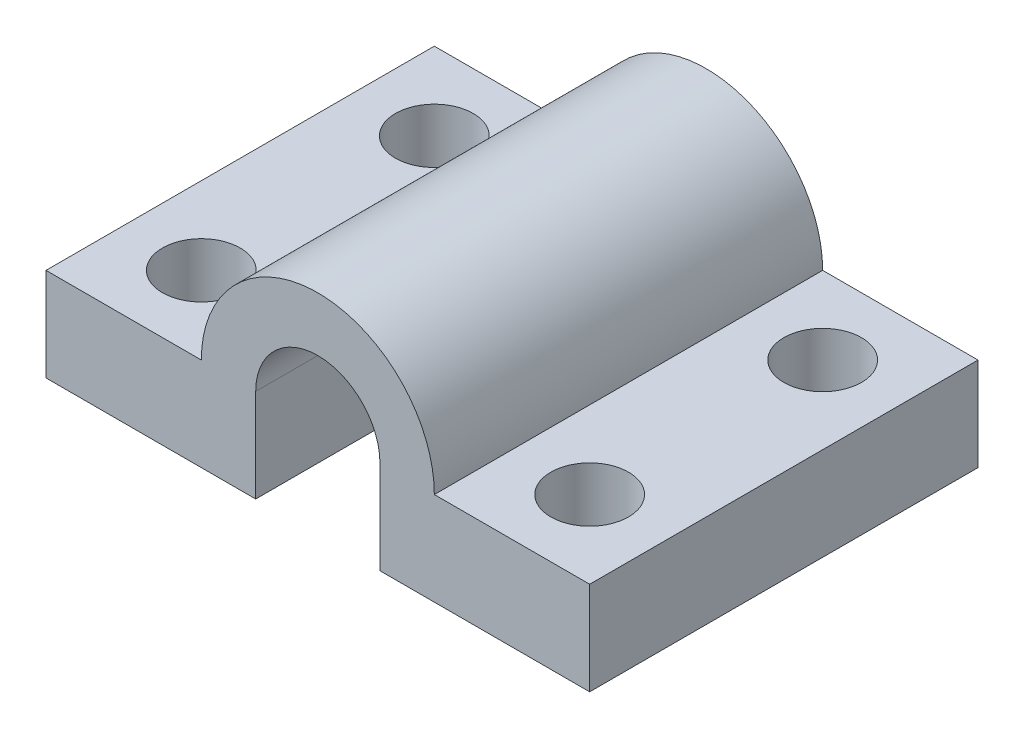
ISO-10303-21;
HEADER;
FILE_DESCRIPTION(('STEP AP214'),'2;1');
FILE_NAME('part.step','',(''),(''),'','','');
FILE_SCHEMA(('AUTOMOTIVE_DESIGN { 1 0 10303 214 1 1 1 1 }'));
ENDSEC;
DATA;
#1=APPLICATION_CONTEXT('core data for automotive mechanical design processes');
#2=APPLICATION_PROTOCOL_DEFINITION('international standard','automotive_design',2000,#1);
#3=PRODUCT_CONTEXT('',#1,'mechanical');
#4=PRODUCT('Part','Part','',(#3));
#5=PRODUCT_RELATED_PRODUCT_CATEGORY('part','',(#4));
#6=PRODUCT_DEFINITION_FORMATION('','',#4);
#7=PRODUCT_DEFINITION_CONTEXT('part definition',#1,'design');
#8=PRODUCT_DEFINITION('design','',#6,#7);
#9=PRODUCT_DEFINITION_SHAPE('','',#8);
#10=(LENGTH_UNIT() NAMED_UNIT(*) SI_UNIT(.MILLI.,.METRE.));
#11=(NAMED_UNIT(*) PLANE_ANGLE_UNIT() SI_UNIT($,.RADIAN.));
#12=(NAMED_UNIT(*) SI_UNIT($,.STERADIAN.) SOLID_ANGLE_UNIT());
#13=UNCERTAINTY_MEASURE_WITH_UNIT(LENGTH_MEASURE(1.E-05),#10,'distance_accuracy_value','');
#14=(GEOMETRIC_REPRESENTATION_CONTEXT(3) GLOBAL_UNCERTAINTY_ASSIGNED_CONTEXT((#13)) GLOBAL_UNIT_ASSIGNED_CONTEXT((#10,
#11,#12)) REPRESENTATION_CONTEXT('',''));
#15=CARTESIAN_POINT('',(0.,0.,0.));
#16=DIRECTION('',(0.,0.,1.));
#17=DIRECTION('',(1.,0.,0.));
#18=AXIS2_PLACEMENT_3D('',#15,#16,#17);
#19=CARTESIAN_POINT('',(-12.2135416666667,6.,16.6145833333333));
#20=DIRECTION('',(0.,0.,-1.));
#21=DIRECTION('',(-1.,0.,0.));
#22=AXIS2_PLACEMENT_3D('',#19,#20,#21);
#23=PLANE('',#22);
#24=DIRECTION('',(0.,-1.,0.));
#25=VECTOR('',#24,1.);
#26=CARTESIAN_POINT('',(9.28645833333333,0.,16.6145833333333));
#27=LINE('',#26,#25);
#28=CARTESIAN_POINT('',(9.28645833333333,6.,16.6145833333333));
#29=VERTEX_POINT('',#28);
#30=CARTESIAN_POINT('',(9.28645833333333,0.,16.6145833333333));
#31=VERTEX_POINT('',#30);
#32=EDGE_CURVE('E115',#29,#31,#27,.T.);
#33=ORIENTED_EDGE('',*,*,#32,.T.);
#34=DIRECTION('',(1.,0.,0.));
#35=VECTOR('',#34,1.);
#36=CARTESIAN_POINT('',(-12.2135416666667,0.,16.6145833333333));
#37=LINE('',#36,#35);
#38=CARTESIAN_POINT('',(22.7864583333333,0.,16.6145833333333));
#39=VERTEX_POINT('',#38);
#40=EDGE_CURVE('E185',#31,#39,#37,.T.);
#41=ORIENTED_EDGE('',*,*,#40,.T.);
#42=DIRECTION('',(0.,-1.,0.));
#43=VECTOR('',#42,1.);
#44=CARTESIAN_POINT('',(22.7864583333333,6.,16.6145833333333));
#45=LINE('',#44,#43);
#46=CARTESIAN_POINT('',(22.7864583333333,6.,16.6145833333333));
#47=VERTEX_POINT('',#46);
#48=EDGE_CURVE('E197',#47,#39,#45,.T.);
#49=ORIENTED_EDGE('',*,*,#48,.F.);
#50=DIRECTION('',(1.,0.,0.));
#51=VECTOR('',#50,1.);
#52=CARTESIAN_POINT('',(-12.2135416666667,6.,16.6145833333333));
#53=LINE('',#52,#51);
#54=CARTESIAN_POINT('',(12.7864583333333,6.,16.6145833333333));
#55=VERTEX_POINT('',#54);
#56=EDGE_CURVE('E174',#55,#47,#53,.T.);
#57=ORIENTED_EDGE('',*,*,#56,.F.);
#58=CARTESIAN_POINT('',(5.28645833333333,6.,16.6145833333333));
#59=DIRECTION('',(0.,0.,-1.));
#60=DIRECTION('',(-1.,0.,0.));
#61=AXIS2_PLACEMENT_3D('',#58,#59,#60);
#62=CIRCLE('',#61,7.5);
#63=CARTESIAN_POINT('',(-2.21354166666667,6.,16.6145833333333));
#64=VERTEX_POINT('',#63);
#65=EDGE_CURVE('E143',#64,#55,#62,.T.);
#66=ORIENTED_EDGE('',*,*,#65,.F.);
#67=CARTESIAN_POINT('',(-12.2135416666667,6.,16.6145833333333));
#68=VERTEX_POINT('',#67);
#69=EDGE_CURVE('E176',#68,#64,#53,.T.);
#70=ORIENTED_EDGE('',*,*,#69,.F.);
#71=DIRECTION('',(0.,-1.,0.));
#72=VECTOR('',#71,1.);
#73=CARTESIAN_POINT('',(-12.2135416666667,6.,16.6145833333333));
#74=LINE('',#73,#72);
#75=CARTESIAN_POINT('',(-12.2135416666667,0.,16.6145833333333));
#76=VERTEX_POINT('',#75);
#77=EDGE_CURVE('E200',#68,#76,#74,.T.);
#78=ORIENTED_EDGE('',*,*,#77,.T.);
#79=CARTESIAN_POINT('',(1.28645833333333,0.,16.6145833333333));
#80=VERTEX_POINT('',#79);
#81=EDGE_CURVE('E127',#76,#80,#37,.T.);
#82=ORIENTED_EDGE('',*,*,#81,.T.);
#83=DIRECTION('',(0.,-1.,0.));
#84=VECTOR('',#83,1.);
#85=CARTESIAN_POINT('',(1.28645833333333,0.,16.6145833333333));
#86=LINE('',#85,#84);
#87=CARTESIAN_POINT('',(1.28645833333333,6.,16.6145833333333));
#88=VERTEX_POINT('',#87);
#89=EDGE_CURVE('E48',#88,#80,#86,.T.);
#90=ORIENTED_EDGE('',*,*,#89,.F.);
#91=CARTESIAN_POINT('',(5.28645833333333,6.,16.6145833333333));
#92=DIRECTION('',(0.,0.,1.));
#93=DIRECTION('',(1.,0.,0.));
#94=AXIS2_PLACEMENT_3D('',#91,#92,#93);
#95=CIRCLE('',#94,4.);
#96=EDGE_CURVE('E118',#29,#88,#95,.T.);
#97=ORIENTED_EDGE('',*,*,#96,.F.);
#98=EDGE_LOOP('',(#33,#41,#49,#57,#66,#70,#78,#82,#90,#97));
#99=FACE_BOUND('',#98,.T.);
#100=ADVANCED_FACE('F33',(#99),#23,.F.);
#101=CARTESIAN_POINT('',(-12.2135416666667,6.,-8.38541666666667));
#102=DIRECTION('',(0.,0.,1.));
#103=DIRECTION('',(1.,0.,0.));
#104=AXIS2_PLACEMENT_3D('',#101,#102,#103);
#105=PLANE('',#104);
#106=DIRECTION('',(0.,-1.,0.));
#107=VECTOR('',#106,1.);
#108=CARTESIAN_POINT('',(9.28645833333333,6.,-8.38541666666667));
#109=LINE('',#108,#107);
#110=CARTESIAN_POINT('',(9.28645833333333,6.,-8.38541666666667));
#111=VERTEX_POINT('',#110);
#112=CARTESIAN_POINT('',(9.28645833333333,0.,-8.38541666666667));
#113=VERTEX_POINT('',#112);
#114=EDGE_CURVE('E133',#111,#113,#109,.T.);
#115=ORIENTED_EDGE('',*,*,#114,.F.);
#116=CARTESIAN_POINT('',(5.28645833333333,6.,-8.38541666666667));
#117=DIRECTION('',(0.,0.,1.));
#118=DIRECTION('',(1.,0.,0.));
#119=AXIS2_PLACEMENT_3D('',#116,#117,#118);
#120=CIRCLE('',#119,4.);
#121=CARTESIAN_POINT('',(1.28645833333333,6.,-8.38541666666667));
#122=VERTEX_POINT('',#121);
#123=EDGE_CURVE('E11',#111,#122,#120,.T.);
#124=ORIENTED_EDGE('',*,*,#123,.T.);
#125=DIRECTION('',(0.,-1.,0.));
#126=VECTOR('',#125,1.);
#127=CARTESIAN_POINT('',(1.28645833333333,6.,-8.38541666666667));
#128=LINE('',#127,#126);
#129=CARTESIAN_POINT('',(1.28645833333333,0.,-8.38541666666667));
#130=VERTEX_POINT('',#129);
#131=EDGE_CURVE('E112',#122,#130,#128,.T.);
#132=ORIENTED_EDGE('',*,*,#131,.T.);
#133=DIRECTION('',(-1.,0.,0.));
#134=VECTOR('',#133,1.);
#135=CARTESIAN_POINT('',(-12.2135416666667,0.,-8.38541666666667));
#136=LINE('',#135,#134);
#137=CARTESIAN_POINT('',(-12.2135416666667,0.,-8.38541666666667));
#138=VERTEX_POINT('',#137);
#139=EDGE_CURVE('E189',#130,#138,#136,.T.);
#140=ORIENTED_EDGE('',*,*,#139,.T.);
#141=DIRECTION('',(0.,-1.,0.));
#142=VECTOR('',#141,1.);
#143=CARTESIAN_POINT('',(-12.2135416666667,6.,-8.38541666666667));
#144=LINE('',#143,#142);
#145=CARTESIAN_POINT('',(-12.2135416666667,6.,-8.38541666666667));
#146=VERTEX_POINT('',#145);
#147=EDGE_CURVE('E182',#146,#138,#144,.T.);
#148=ORIENTED_EDGE('',*,*,#147,.F.);
#149=DIRECTION('',(-1.,0.,0.));
#150=VECTOR('',#149,1.);
#151=CARTESIAN_POINT('',(-12.2135416666667,6.,-8.38541666666667));
#152=LINE('',#151,#150);
#153=CARTESIAN_POINT('',(-2.21354166666667,5.99999999999995,-8.38541666666666));
#154=VERTEX_POINT('',#153);
#155=EDGE_CURVE('E180',#154,#146,#152,.T.);
#156=ORIENTED_EDGE('',*,*,#155,.F.);
#157=CARTESIAN_POINT('',(5.28645833333333,6.,-8.38541666666667));
#158=DIRECTION('',(0.,0.,-1.));
#159=DIRECTION('',(-1.,0.,0.));
#160=AXIS2_PLACEMENT_3D('',#157,#158,#159);
#161=CIRCLE('',#160,7.5);
#162=CARTESIAN_POINT('',(12.7864583333333,6.,-8.38541666666667));
#163=VERTEX_POINT('',#162);
#164=EDGE_CURVE('E141',#154,#163,#161,.T.);
#165=ORIENTED_EDGE('',*,*,#164,.T.);
#166=CARTESIAN_POINT('',(22.7864583333333,6.,-8.38541666666667));
#167=VERTEX_POINT('',#166);
#168=EDGE_CURVE('E56',#167,#163,#152,.T.);
#169=ORIENTED_EDGE('',*,*,#168,.F.);
#170=DIRECTION('',(0.,-1.,0.));
#171=VECTOR('',#170,1.);
#172=CARTESIAN_POINT('',(22.7864583333333,6.,-8.38541666666667));
#173=LINE('',#172,#171);
#174=CARTESIAN_POINT('',(22.7864583333333,0.,-8.38541666666667));
#175=VERTEX_POINT('',#174);
#176=EDGE_CURVE('E194',#167,#175,#173,.T.);
#177=ORIENTED_EDGE('',*,*,#176,.T.);
#178=EDGE_CURVE('E175',#175,#113,#136,.T.);
#179=ORIENTED_EDGE('',*,*,#178,.T.);
#180=EDGE_LOOP('',(#115,#124,#132,#140,#148,#156,#165,#169,#177,#179));
#181=FACE_BOUND('',#180,.T.);
#182=ADVANCED_FACE('F218',(#181),#105,.F.);
#183=CARTESIAN_POINT('',(0.,0.,0.));
#184=DIRECTION('',(0.,1.,0.));
#185=DIRECTION('',(0.,0.,1.));
#186=AXIS2_PLACEMENT_3D('',#183,#184,#185);
#187=PLANE('',#186);
#188=CARTESIAN_POINT('',(17.7864583333333,0.,11.6145833333333));
#189=DIRECTION('',(0.,1.,0.));
#190=DIRECTION('',(0.,0.,1.));
#191=AXIS2_PLACEMENT_3D('',#188,#189,#190);
#192=CIRCLE('',#191,2.5);
#193=CARTESIAN_POINT('',(17.7864583333333,0.,14.1145833333333));
#194=VERTEX_POINT('',#193);
#195=EDGE_CURVE('E154',#194,#194,#192,.T.);
#196=ORIENTED_EDGE('',*,*,#195,.T.);
#197=EDGE_LOOP('',(#196));
#198=FACE_BOUND('',#197,.T.);
#199=CARTESIAN_POINT('',(17.7864583333333,0.,-3.38541666666667));
#200=DIRECTION('',(0.,1.,0.));
#201=DIRECTION('',(0.,0.,1.));
#202=AXIS2_PLACEMENT_3D('',#199,#200,#201);
#203=CIRCLE('',#202,2.5);
#204=CARTESIAN_POINT('',(17.7864583333333,0.,-0.885416666666669));
#205=VERTEX_POINT('',#204);
#206=EDGE_CURVE('E147',#205,#205,#203,.T.);
#207=ORIENTED_EDGE('',*,*,#206,.T.);
#208=EDGE_LOOP('',(#207));
#209=FACE_BOUND('',#208,.T.);
#210=DIRECTION('',(0.,0.,1.));
#211=VECTOR('',#210,1.);
#212=CARTESIAN_POINT('',(9.28645833333333,0.,0.));
#213=LINE('',#212,#211);
#214=EDGE_CURVE('E41',#113,#31,#213,.T.);
#215=ORIENTED_EDGE('',*,*,#214,.F.);
#216=ORIENTED_EDGE('',*,*,#178,.F.);
#217=DIRECTION('',(0.,0.,-1.));
#218=VECTOR('',#217,1.);
#219=CARTESIAN_POINT('',(22.7864583333333,0.,-8.38541666666667));
#220=LINE('',#219,#218);
#221=EDGE_CURVE('E187',#39,#175,#220,.T.);
#222=ORIENTED_EDGE('',*,*,#221,.F.);
#223=ORIENTED_EDGE('',*,*,#40,.F.);
#224=EDGE_LOOP('',(#215,#216,#222,#223));
#225=FACE_BOUND('',#224,.T.);
#226=ADVANCED_FACE('F212',(#198,#209,#225),#187,.F.);
#227=CARTESIAN_POINT('',(0.,6.,0.));
#228=DIRECTION('',(0.,1.,0.));
#229=DIRECTION('',(0.,0.,1.));
#230=AXIS2_PLACEMENT_3D('',#227,#228,#229);
#231=PLANE('',#230);
#232=CARTESIAN_POINT('',(17.7864583333333,6.,11.6145833333333));
#233=DIRECTION('',(0.,1.,0.));
#234=DIRECTION('',(0.,0.,1.));
#235=AXIS2_PLACEMENT_3D('',#232,#233,#234);
#236=CIRCLE('',#235,2.5);
#237=CARTESIAN_POINT('',(17.7864583333333,6.,14.1145833333333));
#238=VERTEX_POINT('',#237);
#239=EDGE_CURVE('E157',#238,#238,#236,.T.);
#240=ORIENTED_EDGE('',*,*,#239,.F.);
#241=EDGE_LOOP('',(#240));
#242=FACE_BOUND('',#241,.T.);
#243=CARTESIAN_POINT('',(17.7864583333333,6.,-3.38541666666667));
#244=DIRECTION('',(0.,1.,0.));
#245=DIRECTION('',(0.,0.,1.));
#246=AXIS2_PLACEMENT_3D('',#243,#244,#245);
#247=CIRCLE('',#246,2.5);
#248=CARTESIAN_POINT('',(17.7864583333333,6.,-0.885416666666669));
#249=VERTEX_POINT('',#248);
#250=EDGE_CURVE('E151',#249,#249,#247,.T.);
#251=ORIENTED_EDGE('',*,*,#250,.F.);
#252=EDGE_LOOP('',(#251));
#253=FACE_BOUND('',#252,.T.);
#254=ORIENTED_EDGE('',*,*,#168,.T.);
#255=DIRECTION('',(0.,0.,-1.));
#256=VECTOR('',#255,1.);
#257=CARTESIAN_POINT('',(12.7864583333333,6.,-8.38541666666667));
#258=LINE('',#257,#256);
#259=EDGE_CURVE('E135',#55,#163,#258,.T.);
#260=ORIENTED_EDGE('',*,*,#259,.F.);
#261=ORIENTED_EDGE('',*,*,#56,.T.);
#262=DIRECTION('',(0.,0.,-1.));
#263=VECTOR('',#262,1.);
#264=CARTESIAN_POINT('',(22.7864583333333,6.,-8.38541666666667));
#265=LINE('',#264,#263);
#266=EDGE_CURVE('E178',#47,#167,#265,.T.);
#267=ORIENTED_EDGE('',*,*,#266,.T.);
#268=EDGE_LOOP('',(#254,#260,#261,#267));
#269=FACE_BOUND('',#268,.T.);
#270=ADVANCED_FACE('F226',(#242,#253,#269),#231,.T.);
#271=CARTESIAN_POINT('',(-7.21354166666667,6.,11.6145833333333));
#272=DIRECTION('',(0.,1.,0.));
#273=DIRECTION('',(0.,0.,1.));
#274=AXIS2_PLACEMENT_3D('',#271,#272,#273);
#275=CIRCLE('',#274,2.5);
#276=CARTESIAN_POINT('',(-7.21354166666667,6.,14.1145833333333));
#277=VERTEX_POINT('',#276);
#278=EDGE_CURVE('E150',#277,#277,#275,.T.);
#279=ORIENTED_EDGE('',*,*,#278,.F.);
#280=EDGE_LOOP('',(#279));
#281=FACE_BOUND('',#280,.T.);
#282=CARTESIAN_POINT('',(-7.21354166666668,6.,-3.38541666666667));
#283=DIRECTION('',(0.,1.,0.));
#284=DIRECTION('',(0.,0.,1.));
#285=AXIS2_PLACEMENT_3D('',#282,#283,#284);
#286=CIRCLE('',#285,2.5);
#287=CARTESIAN_POINT('',(-7.21354166666668,6.,-0.885416666666669));
#288=VERTEX_POINT('',#287);
#289=EDGE_CURVE('E146',#288,#288,#286,.T.);
#290=ORIENTED_EDGE('',*,*,#289,.F.);
#291=EDGE_LOOP('',(#290));
#292=FACE_BOUND('',#291,.T.);
#293=ORIENTED_EDGE('',*,*,#69,.T.);
#294=DIRECTION('',(0.,0.,-1.));
#295=VECTOR('',#294,1.);
#296=CARTESIAN_POINT('',(-2.21354166666667,5.99999999999995,-8.38541666666666));
#297=LINE('',#296,#295);
#298=EDGE_CURVE('E138',#64,#154,#297,.T.);
#299=ORIENTED_EDGE('',*,*,#298,.T.);
#300=ORIENTED_EDGE('',*,*,#155,.T.);
#301=DIRECTION('',(0.,0.,1.));
#302=VECTOR('',#301,1.);
#303=CARTESIAN_POINT('',(-12.2135416666667,6.,-8.38541666666667));
#304=LINE('',#303,#302);
#305=EDGE_CURVE('E171',#146,#68,#304,.T.);
#306=ORIENTED_EDGE('',*,*,#305,.T.);
#307=EDGE_LOOP('',(#293,#299,#300,#306));
#308=FACE_BOUND('',#307,.T.);
#309=ADVANCED_FACE('F228',(#281,#292,#308),#231,.T.);
#310=CARTESIAN_POINT('',(-12.2135416666667,6.,-8.38541666666667));
#311=DIRECTION('',(1.,0.,0.));
#312=DIRECTION('',(0.,0.,-1.));
#313=AXIS2_PLACEMENT_3D('',#310,#311,#312);
#314=PLANE('',#313);
#315=DIRECTION('',(0.,0.,1.));
#316=VECTOR('',#315,1.);
#317=CARTESIAN_POINT('',(-12.2135416666667,0.,-8.38541666666667));
#318=LINE('',#317,#316);
#319=EDGE_CURVE('E168',#138,#76,#318,.T.);
#320=ORIENTED_EDGE('',*,*,#319,.T.);
#321=ORIENTED_EDGE('',*,*,#77,.F.);
#322=ORIENTED_EDGE('',*,*,#305,.F.);
#323=ORIENTED_EDGE('',*,*,#147,.T.);
#324=EDGE_LOOP('',(#320,#321,#322,#323));
#325=FACE_BOUND('',#324,.T.);
#326=ADVANCED_FACE('F35',(#325),#314,.F.);
#327=CARTESIAN_POINT('',(22.7864583333333,6.,-8.38541666666667));
#328=DIRECTION('',(-1.,0.,0.));
#329=DIRECTION('',(0.,0.,1.));
#330=AXIS2_PLACEMENT_3D('',#327,#328,#329);
#331=PLANE('',#330);
#332=ORIENTED_EDGE('',*,*,#221,.T.);
#333=ORIENTED_EDGE('',*,*,#176,.F.);
#334=ORIENTED_EDGE('',*,*,#266,.F.);
#335=ORIENTED_EDGE('',*,*,#48,.T.);
#336=EDGE_LOOP('',(#332,#333,#334,#335));
#337=FACE_BOUND('',#336,.T.);
#338=ADVANCED_FACE('F215',(#337),#331,.F.);
#339=CARTESIAN_POINT('',(-7.21354166666668,0.,-3.38541666666667));
#340=DIRECTION('',(0.,1.,0.));
#341=DIRECTION('',(0.,0.,1.));
#342=AXIS2_PLACEMENT_3D('',#339,#340,#341);
#343=CIRCLE('',#342,2.5);
#344=CARTESIAN_POINT('',(-7.21354166666668,0.,-0.885416666666669));
#345=VERTEX_POINT('',#344);
#346=EDGE_CURVE('E160',#345,#345,#343,.T.);
#347=ORIENTED_EDGE('',*,*,#346,.T.);
#348=EDGE_LOOP('',(#347));
#349=FACE_BOUND('',#348,.T.);
#350=CARTESIAN_POINT('',(-7.21354166666667,0.,11.6145833333333));
#351=DIRECTION('',(0.,1.,0.));
#352=DIRECTION('',(0.,0.,1.));
#353=AXIS2_PLACEMENT_3D('',#350,#351,#352);
#354=CIRCLE('',#353,2.5);
#355=CARTESIAN_POINT('',(-7.21354166666667,0.,14.1145833333333));
#356=VERTEX_POINT('',#355);
#357=EDGE_CURVE('E165',#356,#356,#354,.T.);
#358=ORIENTED_EDGE('',*,*,#357,.T.);
#359=EDGE_LOOP('',(#358));
#360=FACE_BOUND('',#359,.T.);
#361=ORIENTED_EDGE('',*,*,#139,.F.);
#362=DIRECTION('',(0.,0.,1.));
#363=VECTOR('',#362,1.);
#364=CARTESIAN_POINT('',(1.28645833333333,0.,0.));
#365=LINE('',#364,#363);
#366=EDGE_CURVE('E202',#130,#80,#365,.T.);
#367=ORIENTED_EDGE('',*,*,#366,.T.);
#368=ORIENTED_EDGE('',*,*,#81,.F.);
#369=ORIENTED_EDGE('',*,*,#319,.F.);
#370=EDGE_LOOP('',(#361,#367,#368,#369));
#371=FACE_BOUND('',#370,.T.);
#372=ADVANCED_FACE('F235',(#349,#360,#371),#187,.F.);
#373=CARTESIAN_POINT('',(-7.21354166666667,0.,11.6145833333333));
#374=DIRECTION('',(0.,1.,0.));
#375=DIRECTION('',(0.,0.,1.));
#376=AXIS2_PLACEMENT_3D('',#373,#374,#375);
#377=CYLINDRICAL_SURFACE('',#376,2.5);
#378=ORIENTED_EDGE('',*,*,#357,.F.);
#379=EDGE_LOOP('',(#378));
#380=FACE_BOUND('',#379,.T.);
#381=ORIENTED_EDGE('',*,*,#278,.T.);
#382=EDGE_LOOP('',(#381));
#383=FACE_BOUND('',#382,.T.);
#384=ADVANCED_FACE('F237',(#380,#383),#377,.F.);
#385=CARTESIAN_POINT('',(17.7864583333333,0.,-3.38541666666667));
#386=DIRECTION('',(0.,1.,0.));
#387=DIRECTION('',(0.,0.,1.));
#388=AXIS2_PLACEMENT_3D('',#385,#386,#387);
#389=CYLINDRICAL_SURFACE('',#388,2.5);
#390=ORIENTED_EDGE('',*,*,#206,.F.);
#391=EDGE_LOOP('',(#390));
#392=FACE_BOUND('',#391,.T.);
#393=ORIENTED_EDGE('',*,*,#250,.T.);
#394=EDGE_LOOP('',(#393));
#395=FACE_BOUND('',#394,.T.);
#396=ADVANCED_FACE('F244',(#392,#395),#389,.F.);
#397=CARTESIAN_POINT('',(17.7864583333333,0.,11.6145833333333));
#398=DIRECTION('',(0.,1.,0.));
#399=DIRECTION('',(0.,0.,1.));
#400=AXIS2_PLACEMENT_3D('',#397,#398,#399);
#401=CYLINDRICAL_SURFACE('',#400,2.5);
#402=ORIENTED_EDGE('',*,*,#195,.F.);
#403=EDGE_LOOP('',(#402));
#404=FACE_BOUND('',#403,.T.);
#405=ORIENTED_EDGE('',*,*,#239,.T.);
#406=EDGE_LOOP('',(#405));
#407=FACE_BOUND('',#406,.T.);
#408=ADVANCED_FACE('F302',(#404,#407),#401,.F.);
#409=CARTESIAN_POINT('',(-7.21354166666668,0.,-3.38541666666667));
#410=DIRECTION('',(0.,1.,0.));
#411=DIRECTION('',(0.,0.,1.));
#412=AXIS2_PLACEMENT_3D('',#409,#410,#411);
#413=CYLINDRICAL_SURFACE('',#412,2.5);
#414=ORIENTED_EDGE('',*,*,#346,.F.);
#415=EDGE_LOOP('',(#414));
#416=FACE_BOUND('',#415,.T.);
#417=ORIENTED_EDGE('',*,*,#289,.T.);
#418=EDGE_LOOP('',(#417));
#419=FACE_BOUND('',#418,.T.);
#420=ADVANCED_FACE('F311',(#416,#419),#413,.F.);
#421=CARTESIAN_POINT('',(5.28645833333333,6.,-8.38541666666667));
#422=DIRECTION('',(0.,0.,-1.));
#423=DIRECTION('',(-1.,0.,0.));
#424=AXIS2_PLACEMENT_3D('',#421,#422,#423);
#425=CYLINDRICAL_SURFACE('',#424,7.5);
#426=ORIENTED_EDGE('',*,*,#164,.F.);
#427=ORIENTED_EDGE('',*,*,#298,.F.);
#428=ORIENTED_EDGE('',*,*,#65,.T.);
#429=ORIENTED_EDGE('',*,*,#259,.T.);
#430=EDGE_LOOP('',(#426,#427,#428,#429));
#431=FACE_BOUND('',#430,.T.);
#432=ADVANCED_FACE('F223',(#431),#425,.T.);
#433=CARTESIAN_POINT('',(5.28645833333333,6.,-19.3854166666667));
#434=DIRECTION('',(0.,0.,1.));
#435=DIRECTION('',(1.,0.,0.));
#436=AXIS2_PLACEMENT_3D('',#433,#434,#435);
#437=CYLINDRICAL_SURFACE('',#436,4.);
#438=DIRECTION('',(0.,0.,1.));
#439=VECTOR('',#438,1.);
#440=CARTESIAN_POINT('',(9.28645833333333,6.,-19.3854166666667));
#441=LINE('',#440,#439);
#442=EDGE_CURVE('E114',#111,#29,#441,.T.);
#443=ORIENTED_EDGE('',*,*,#442,.T.);
#444=ORIENTED_EDGE('',*,*,#96,.T.);
#445=DIRECTION('',(0.,0.,1.));
#446=VECTOR('',#445,1.);
#447=CARTESIAN_POINT('',(1.28645833333333,6.,-19.3854166666667));
#448=LINE('',#447,#446);
#449=EDGE_CURVE('E108',#122,#88,#448,.T.);
#450=ORIENTED_EDGE('',*,*,#449,.F.);
#451=ORIENTED_EDGE('',*,*,#123,.F.);
#452=EDGE_LOOP('',(#443,#444,#450,#451));
#453=FACE_BOUND('',#452,.T.);
#454=ADVANCED_FACE('F119',(#453),#437,.F.);
#455=CARTESIAN_POINT('',(9.28645833333333,0.,-19.3854166666667));
#456=DIRECTION('',(-1.,0.,0.));
#457=DIRECTION('',(0.,0.,1.));
#458=AXIS2_PLACEMENT_3D('',#455,#456,#457);
#459=PLANE('',#458);
#460=ORIENTED_EDGE('',*,*,#114,.T.);
#461=ORIENTED_EDGE('',*,*,#214,.T.);
#462=ORIENTED_EDGE('',*,*,#32,.F.);
#463=ORIENTED_EDGE('',*,*,#442,.F.);
#464=EDGE_LOOP('',(#460,#461,#462,#463));
#465=FACE_BOUND('',#464,.T.);
#466=ADVANCED_FACE('F205',(#465),#459,.T.);
#467=CARTESIAN_POINT('',(1.28645833333333,0.,-19.3854166666667));
#468=DIRECTION('',(-1.,0.,0.));
#469=DIRECTION('',(0.,0.,1.));
#470=AXIS2_PLACEMENT_3D('',#467,#468,#469);
#471=PLANE('',#470);
#472=ORIENTED_EDGE('',*,*,#449,.T.);
#473=ORIENTED_EDGE('',*,*,#89,.T.);
#474=ORIENTED_EDGE('',*,*,#366,.F.);
#475=ORIENTED_EDGE('',*,*,#131,.F.);
#476=EDGE_LOOP('',(#472,#473,#474,#475));
#477=FACE_BOUND('',#476,.T.);
#478=ADVANCED_FACE('F110',(#477),#471,.F.);
#479=CLOSED_SHELL('',(#100,#182,#226,#270,#309,#326,#338,#372,#384,#396,#408,#420,#432,#454,
#466,#478));
#480=MANIFOLD_SOLID_BREP('B2',#479);
#481=ADVANCED_BREP_SHAPE_REPRESENTATION('',(#18,#480),#14);
#482=SHAPE_DEFINITION_REPRESENTATION(#9,#481);
ENDSEC;
END-ISO-10303-21;
